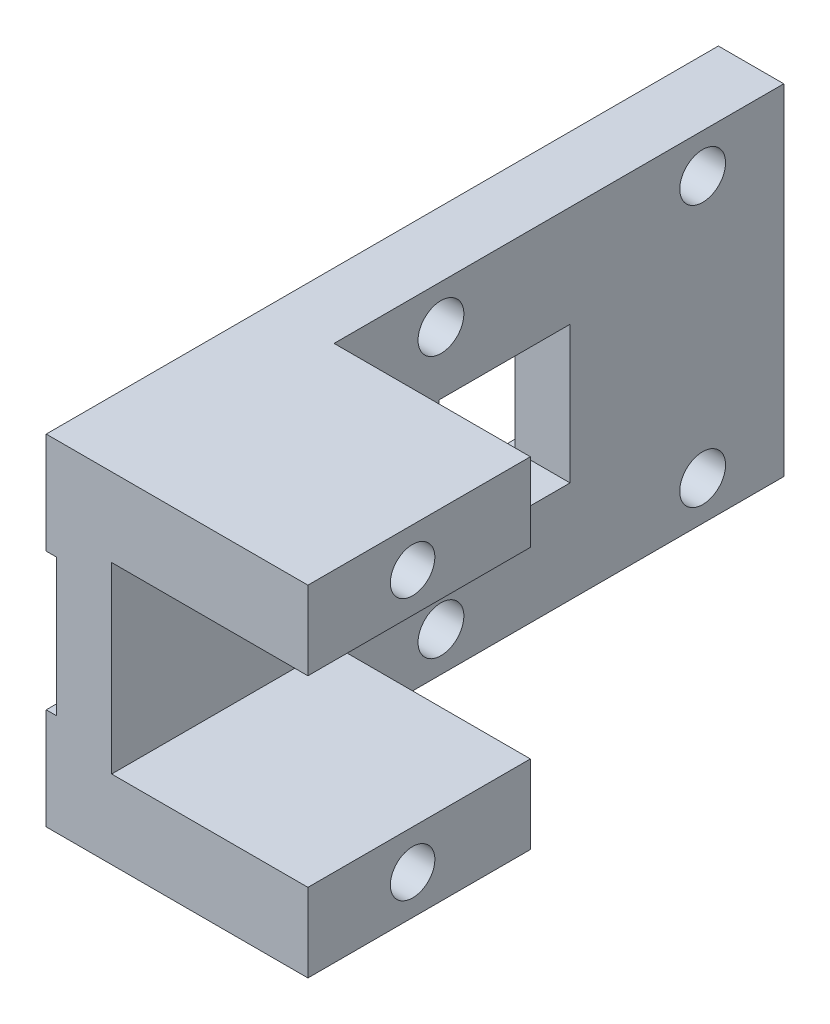
ISO-10303-21;
HEADER;
FILE_DESCRIPTION(('STEP AP214'),'2;1');
FILE_NAME('part.step','',(''),(''),'','','');
FILE_SCHEMA(('AUTOMOTIVE_DESIGN { 1 0 10303 214 1 1 1 1 }'));
ENDSEC;
DATA;
#1=APPLICATION_CONTEXT('core data for automotive mechanical design processes');
#2=APPLICATION_PROTOCOL_DEFINITION('international standard','automotive_design',2000,#1);
#3=PRODUCT_CONTEXT('',#1,'mechanical');
#4=PRODUCT('Part','Part','',(#3));
#5=PRODUCT_RELATED_PRODUCT_CATEGORY('part','',(#4));
#6=PRODUCT_DEFINITION_FORMATION('','',#4);
#7=PRODUCT_DEFINITION_CONTEXT('part definition',#1,'design');
#8=PRODUCT_DEFINITION('design','',#6,#7);
#9=PRODUCT_DEFINITION_SHAPE('','',#8);
#10=(LENGTH_UNIT() NAMED_UNIT(*) SI_UNIT(.MILLI.,.METRE.));
#11=(NAMED_UNIT(*) PLANE_ANGLE_UNIT() SI_UNIT($,.RADIAN.));
#12=(NAMED_UNIT(*) SI_UNIT($,.STERADIAN.) SOLID_ANGLE_UNIT());
#13=UNCERTAINTY_MEASURE_WITH_UNIT(LENGTH_MEASURE(1.E-05),#10,'distance_accuracy_value','');
#14=(GEOMETRIC_REPRESENTATION_CONTEXT(3) GLOBAL_UNCERTAINTY_ASSIGNED_CONTEXT((#13)) GLOBAL_UNIT_ASSIGNED_CONTEXT((#10,
#11,#12)) REPRESENTATION_CONTEXT('',''));
#15=CARTESIAN_POINT('',(0.,0.,0.));
#16=DIRECTION('',(0.,0.,1.));
#17=DIRECTION('',(1.,0.,0.));
#18=AXIS2_PLACEMENT_3D('',#15,#16,#17);
#19=CARTESIAN_POINT('',(-146.99996276809,-124.000037425625,-132.46692088768));
#20=DIRECTION('',(0.,1.,0.));
#21=DIRECTION('',(1.,0.,0.));
#22=AXIS2_PLACEMENT_3D('',#19,#20,#21);
#23=PLANE('',#22);
#24=DIRECTION('',(0.,0.,1.));
#25=VECTOR('',#24,1.);
#26=CARTESIAN_POINT('',(-146.99996276809,-124.000037425625,-132.46692088768));
#27=LINE('',#26,#25);
#28=CARTESIAN_POINT('',(-146.99996276809,-124.000037425625,-132.46692088768));
#29=VERTEX_POINT('',#28);
#30=CARTESIAN_POINT('',(-146.99996276809,-124.000037425625,-97.3000017784545));
#31=VERTEX_POINT('',#30);
#32=EDGE_CURVE('E436',#29,#31,#27,.T.);
#33=ORIENTED_EDGE('',*,*,#32,.F.);
#34=DIRECTION('',(0.,0.,1.));
#35=VECTOR('',#34,1.);
#36=CARTESIAN_POINT('',(-146.99996276809,-124.000037425625,-132.46692088768));
#37=LINE('',#36,#35);
#38=CARTESIAN_POINT('',(-146.99996276809,-124.000037425625,-148.66692088768));
#39=VERTEX_POINT('',#38);
#40=EDGE_CURVE('E362',#39,#29,#37,.T.);
#41=ORIENTED_EDGE('',*,*,#40,.F.);
#42=DIRECTION('',(-1.,0.,0.));
#43=VECTOR('',#42,1.);
#44=CARTESIAN_POINT('',(-146.99996276809,-124.000037425625,-148.66692088768));
#45=LINE('',#44,#43);
#46=CARTESIAN_POINT('',(-141.99996276809,-124.000037425625,-148.66692088768));
#47=VERTEX_POINT('',#46);
#48=EDGE_CURVE('E432',#47,#39,#45,.T.);
#49=ORIENTED_EDGE('',*,*,#48,.F.);
#50=DIRECTION('',(0.,0.,-1.));
#51=VECTOR('',#50,1.);
#52=CARTESIAN_POINT('',(-141.99996276809,-124.000037425625,-127.333461333067));
#53=LINE('',#52,#51);
#54=CARTESIAN_POINT('',(-141.99996276809,-124.000037425625,-132.46692088768));
#55=VERTEX_POINT('',#54);
#56=EDGE_CURVE('E435',#55,#47,#53,.T.);
#57=ORIENTED_EDGE('',*,*,#56,.F.);
#58=DIRECTION('',(0.,0.,1.));
#59=VECTOR('',#58,1.);
#60=CARTESIAN_POINT('',(-141.99996276809,-124.000037425625,-132.46692088768));
#61=LINE('',#60,#59);
#62=CARTESIAN_POINT('',(-141.99996276809,-124.000037425625,-114.300001778454));
#63=VERTEX_POINT('',#62);
#64=EDGE_CURVE('E401',#55,#63,#61,.T.);
#65=ORIENTED_EDGE('',*,*,#64,.T.);
#66=DIRECTION('',(1.,0.,0.));
#67=VECTOR('',#66,1.);
#68=CARTESIAN_POINT('',(-141.99996276809,-124.000037425625,-114.300001778454));
#69=LINE('',#68,#67);
#70=CARTESIAN_POINT('',(-126.99996276809,-124.000037425625,-114.300001778454));
#71=VERTEX_POINT('',#70);
#72=EDGE_CURVE('E374',#63,#71,#69,.T.);
#73=ORIENTED_EDGE('',*,*,#72,.T.);
#74=DIRECTION('',(0.,0.,1.));
#75=VECTOR('',#74,1.);
#76=CARTESIAN_POINT('',(-126.99996276809,-124.000037425625,-114.300001778454));
#77=LINE('',#76,#75);
#78=CARTESIAN_POINT('',(-126.99996276809,-124.000037425625,-97.3000017784545));
#79=VERTEX_POINT('',#78);
#80=EDGE_CURVE('E174',#71,#79,#77,.T.);
#81=ORIENTED_EDGE('',*,*,#80,.T.);
#82=DIRECTION('',(-1.,0.,0.));
#83=VECTOR('',#82,1.);
#84=CARTESIAN_POINT('',(-141.99996276809,-124.000037425625,-97.3000017784545));
#85=LINE('',#84,#83);
#86=EDGE_CURVE('E330',#79,#31,#85,.T.);
#87=ORIENTED_EDGE('',*,*,#86,.T.);
#88=EDGE_LOOP('',(#33,#41,#49,#57,#65,#73,#81,#87));
#89=FACE_BOUND('',#88,.T.);
#90=ADVANCED_FACE('F16',(#89),#23,.F.);
#91=CARTESIAN_POINT('',(-146.99996276809,-98.0000370381948,-106.000001778454));
#92=DIRECTION('',(0.,-1.,0.));
#93=DIRECTION('',(0.,0.,-1.));
#94=AXIS2_PLACEMENT_3D('',#91,#92,#93);
#95=PLANE('',#94);
#96=DIRECTION('',(0.,0.,1.));
#97=VECTOR('',#96,1.);
#98=CARTESIAN_POINT('',(-146.99996276809,-98.0000370381948,-106.000001778454));
#99=LINE('',#98,#97);
#100=CARTESIAN_POINT('',(-146.99996276809,-98.0000370381948,-132.46692088768));
#101=VERTEX_POINT('',#100);
#102=CARTESIAN_POINT('',(-146.99996276809,-98.0000370381948,-97.3000017784545));
#103=VERTEX_POINT('',#102);
#104=EDGE_CURVE('E446',#101,#103,#99,.T.);
#105=ORIENTED_EDGE('',*,*,#104,.T.);
#106=DIRECTION('',(1.,0.,0.));
#107=VECTOR('',#106,1.);
#108=CARTESIAN_POINT('',(-146.99996276809,-98.0000370381948,-97.3000017784545));
#109=LINE('',#108,#107);
#110=CARTESIAN_POINT('',(-126.99996276809,-98.0000370381948,-97.3000017784545));
#111=VERTEX_POINT('',#110);
#112=EDGE_CURVE('E326',#103,#111,#109,.T.);
#113=ORIENTED_EDGE('',*,*,#112,.T.);
#114=DIRECTION('',(0.,0.,1.));
#115=VECTOR('',#114,1.);
#116=CARTESIAN_POINT('',(-126.99996276809,-98.0000370381948,-102.300001778455));
#117=LINE('',#116,#115);
#118=CARTESIAN_POINT('',(-126.99996276809,-98.0000370381948,-114.300001778454));
#119=VERTEX_POINT('',#118);
#120=EDGE_CURVE('E398',#119,#111,#117,.T.);
#121=ORIENTED_EDGE('',*,*,#120,.F.);
#122=DIRECTION('',(1.,0.,0.));
#123=VECTOR('',#122,1.);
#124=CARTESIAN_POINT('',(-141.99996276809,-98.0000370381948,-114.300001778454));
#125=LINE('',#124,#123);
#126=CARTESIAN_POINT('',(-141.99996276809,-98.0000370381948,-114.300001778454));
#127=VERTEX_POINT('',#126);
#128=EDGE_CURVE('E307',#127,#119,#125,.T.);
#129=ORIENTED_EDGE('',*,*,#128,.F.);
#130=DIRECTION('',(0.,0.,1.));
#131=VECTOR('',#130,1.);
#132=CARTESIAN_POINT('',(-141.99996276809,-98.0000370381948,-106.000001778454));
#133=LINE('',#132,#131);
#134=CARTESIAN_POINT('',(-141.99996276809,-98.0000370381948,-132.46692088768));
#135=VERTEX_POINT('',#134);
#136=EDGE_CURVE('E423',#135,#127,#133,.T.);
#137=ORIENTED_EDGE('',*,*,#136,.F.);
#138=DIRECTION('',(0.,0.,1.));
#139=VECTOR('',#138,1.);
#140=CARTESIAN_POINT('',(-141.99996276809,-98.0000370381948,-127.333461333067));
#141=LINE('',#140,#139);
#142=CARTESIAN_POINT('',(-141.99996276809,-98.0000370381948,-148.66692088768));
#143=VERTEX_POINT('',#142);
#144=EDGE_CURVE('E427',#143,#135,#141,.T.);
#145=ORIENTED_EDGE('',*,*,#144,.F.);
#146=DIRECTION('',(1.,0.,0.));
#147=VECTOR('',#146,1.);
#148=CARTESIAN_POINT('',(-146.99996276809,-98.0000370381948,-148.66692088768));
#149=LINE('',#148,#147);
#150=CARTESIAN_POINT('',(-146.99996276809,-98.0000370381948,-148.66692088768));
#151=VERTEX_POINT('',#150);
#152=EDGE_CURVE('E102',#151,#143,#149,.T.);
#153=ORIENTED_EDGE('',*,*,#152,.F.);
#154=DIRECTION('',(0.,0.,-1.));
#155=VECTOR('',#154,1.);
#156=CARTESIAN_POINT('',(-146.99996276809,-98.0000370381948,-106.000001778454));
#157=LINE('',#156,#155);
#158=EDGE_CURVE('E20',#101,#151,#157,.T.);
#159=ORIENTED_EDGE('',*,*,#158,.F.);
#160=EDGE_LOOP('',(#105,#113,#121,#129,#137,#145,#153,#159));
#161=FACE_BOUND('',#160,.T.);
#162=ADVANCED_FACE('F563',(#161),#95,.F.);
#163=CARTESIAN_POINT('',(-146.99996276809,-101.00003723191,-122.46692088768));
#164=DIRECTION('',(-1.,0.,0.));
#165=DIRECTION('',(0.,-1.,0.));
#166=AXIS2_PLACEMENT_3D('',#163,#164,#165);
#167=CYLINDRICAL_SURFACE('',#166,1.75);
#168=CARTESIAN_POINT('',(-141.99996276809,-101.00003723191,-122.46692088768));
#169=DIRECTION('',(1.,0.,0.));
#170=DIRECTION('',(0.,-1.,0.));
#171=AXIS2_PLACEMENT_3D('',#168,#169,#170);
#172=CIRCLE('',#171,1.75);
#173=CARTESIAN_POINT('',(-141.99996276809,-99.25003723191,-122.46692088768));
#174=VERTEX_POINT('',#173);
#175=EDGE_CURVE('E321',#174,#174,#172,.T.);
#176=ORIENTED_EDGE('',*,*,#175,.T.);
#177=DIRECTION('',(-1.,0.,0.));
#178=VECTOR('',#177,1.);
#179=CARTESIAN_POINT('',(-146.99996276809,-99.25003723191,-122.46692088768));
#180=LINE('',#179,#178);
#181=CARTESIAN_POINT('',(-146.99996276809,-99.25003723191,-122.46692088768));
#182=VERTEX_POINT('',#181);
#183=EDGE_CURVE('E11',#174,#182,#180,.T.);
#184=ORIENTED_EDGE('',*,*,#183,.T.);
#185=CARTESIAN_POINT('',(-146.99996276809,-101.00003723191,-122.46692088768));
#186=DIRECTION('',(1.,0.,0.));
#187=DIRECTION('',(0.,-1.,0.));
#188=AXIS2_PLACEMENT_3D('',#185,#186,#187);
#189=CIRCLE('',#188,1.75);
#190=EDGE_CURVE('E367',#182,#182,#189,.T.);
#191=ORIENTED_EDGE('',*,*,#190,.F.);
#192=ORIENTED_EDGE('',*,*,#183,.F.);
#193=EDGE_LOOP('',(#176,#184,#191,#192));
#194=FACE_BOUND('',#193,.T.);
#195=ADVANCED_FACE('F607',(#194),#167,.F.);
#196=CARTESIAN_POINT('',(-146.99996276809,-121.00003723191,-142.46692088768));
#197=DIRECTION('',(-1.,0.,0.));
#198=DIRECTION('',(0.,-1.,0.));
#199=AXIS2_PLACEMENT_3D('',#196,#197,#198);
#200=CYLINDRICAL_SURFACE('',#199,1.75);
#201=CARTESIAN_POINT('',(-141.99996276809,-121.00003723191,-142.46692088768));
#202=DIRECTION('',(1.,0.,0.));
#203=DIRECTION('',(0.,-1.,0.));
#204=AXIS2_PLACEMENT_3D('',#201,#202,#203);
#205=CIRCLE('',#204,1.75);
#206=CARTESIAN_POINT('',(-141.99996276809,-119.25003723191,-142.46692088768));
#207=VERTEX_POINT('',#206);
#208=EDGE_CURVE('E316',#207,#207,#205,.T.);
#209=ORIENTED_EDGE('',*,*,#208,.T.);
#210=DIRECTION('',(-1.,0.,0.));
#211=VECTOR('',#210,1.);
#212=CARTESIAN_POINT('',(-146.99996276809,-119.25003723191,-142.46692088768));
#213=LINE('',#212,#211);
#214=CARTESIAN_POINT('',(-146.99996276809,-119.25003723191,-142.46692088768));
#215=VERTEX_POINT('',#214);
#216=EDGE_CURVE('E27',#207,#215,#213,.T.);
#217=ORIENTED_EDGE('',*,*,#216,.T.);
#218=CARTESIAN_POINT('',(-146.99996276809,-121.00003723191,-142.46692088768));
#219=DIRECTION('',(1.,0.,0.));
#220=DIRECTION('',(0.,-1.,0.));
#221=AXIS2_PLACEMENT_3D('',#218,#219,#220);
#222=CIRCLE('',#221,1.75);
#223=EDGE_CURVE('E386',#215,#215,#222,.T.);
#224=ORIENTED_EDGE('',*,*,#223,.F.);
#225=ORIENTED_EDGE('',*,*,#216,.F.);
#226=EDGE_LOOP('',(#209,#217,#224,#225));
#227=FACE_BOUND('',#226,.T.);
#228=ADVANCED_FACE('F615',(#227),#200,.F.);
#229=CARTESIAN_POINT('',(-146.99996276809,-121.00003723191,-122.46692088768));
#230=DIRECTION('',(-1.,0.,0.));
#231=DIRECTION('',(0.,-1.,0.));
#232=AXIS2_PLACEMENT_3D('',#229,#230,#231);
#233=CYLINDRICAL_SURFACE('',#232,1.75);
#234=CARTESIAN_POINT('',(-141.99996276809,-121.00003723191,-122.46692088768));
#235=DIRECTION('',(1.,0.,0.));
#236=DIRECTION('',(0.,-1.,0.));
#237=AXIS2_PLACEMENT_3D('',#234,#235,#236);
#238=CIRCLE('',#237,1.75);
#239=CARTESIAN_POINT('',(-141.99996276809,-119.25003723191,-122.46692088768));
#240=VERTEX_POINT('',#239);
#241=EDGE_CURVE('E320',#240,#240,#238,.T.);
#242=ORIENTED_EDGE('',*,*,#241,.T.);
#243=DIRECTION('',(-1.,0.,0.));
#244=VECTOR('',#243,1.);
#245=CARTESIAN_POINT('',(-146.99996276809,-119.25003723191,-122.46692088768));
#246=LINE('',#245,#244);
#247=CARTESIAN_POINT('',(-146.99996276809,-119.25003723191,-122.46692088768));
#248=VERTEX_POINT('',#247);
#249=EDGE_CURVE('E315',#240,#248,#246,.T.);
#250=ORIENTED_EDGE('',*,*,#249,.T.);
#251=CARTESIAN_POINT('',(-146.99996276809,-121.00003723191,-122.46692088768));
#252=DIRECTION('',(1.,0.,0.));
#253=DIRECTION('',(0.,-1.,0.));
#254=AXIS2_PLACEMENT_3D('',#251,#252,#253);
#255=CIRCLE('',#254,1.75);
#256=EDGE_CURVE('E391',#248,#248,#255,.T.);
#257=ORIENTED_EDGE('',*,*,#256,.F.);
#258=ORIENTED_EDGE('',*,*,#249,.F.);
#259=EDGE_LOOP('',(#242,#250,#257,#258));
#260=FACE_BOUND('',#259,.T.);
#261=ADVANCED_FACE('F640',(#260),#233,.F.);
#262=CARTESIAN_POINT('',(-146.99996276809,-101.00003723191,-142.46692088768));
#263=DIRECTION('',(-1.,0.,0.));
#264=DIRECTION('',(0.,-1.,0.));
#265=AXIS2_PLACEMENT_3D('',#262,#263,#264);
#266=CYLINDRICAL_SURFACE('',#265,1.75);
#267=CARTESIAN_POINT('',(-141.99996276809,-101.00003723191,-142.46692088768));
#268=DIRECTION('',(1.,0.,0.));
#269=DIRECTION('',(0.,-1.,0.));
#270=AXIS2_PLACEMENT_3D('',#267,#268,#269);
#271=CIRCLE('',#270,1.75);
#272=CARTESIAN_POINT('',(-141.99996276809,-99.25003723191,-142.46692088768));
#273=VERTEX_POINT('',#272);
#274=EDGE_CURVE('E378',#273,#273,#271,.T.);
#275=ORIENTED_EDGE('',*,*,#274,.T.);
#276=DIRECTION('',(-1.,0.,0.));
#277=VECTOR('',#276,1.);
#278=CARTESIAN_POINT('',(-146.99996276809,-99.25003723191,-142.46692088768));
#279=LINE('',#278,#277);
#280=CARTESIAN_POINT('',(-146.99996276809,-99.25003723191,-142.46692088768));
#281=VERTEX_POINT('',#280);
#282=EDGE_CURVE('E41',#273,#281,#279,.T.);
#283=ORIENTED_EDGE('',*,*,#282,.T.);
#284=CARTESIAN_POINT('',(-146.99996276809,-101.00003723191,-142.46692088768));
#285=DIRECTION('',(1.,0.,0.));
#286=DIRECTION('',(0.,-1.,0.));
#287=AXIS2_PLACEMENT_3D('',#284,#285,#286);
#288=CIRCLE('',#287,1.75);
#289=EDGE_CURVE('E370',#281,#281,#288,.T.);
#290=ORIENTED_EDGE('',*,*,#289,.F.);
#291=ORIENTED_EDGE('',*,*,#282,.F.);
#292=EDGE_LOOP('',(#275,#283,#290,#291));
#293=FACE_BOUND('',#292,.T.);
#294=ADVANCED_FACE('F656',(#293),#266,.F.);
#295=CARTESIAN_POINT('',(-146.19996276809,-111.00003723191,-127.333461333067));
#296=DIRECTION('',(-1.,0.,0.));
#297=DIRECTION('',(0.,1.,0.));
#298=AXIS2_PLACEMENT_3D('',#295,#296,#297);
#299=PLANE('',#298);
#300=DIRECTION('',(0.,-1.,0.));
#301=VECTOR('',#300,1.);
#302=CARTESIAN_POINT('',(-146.19996276809,-108.47503723191,-132.333461333067));
#303=LINE('',#302,#301);
#304=CARTESIAN_POINT('',(-146.19996276809,-105.75003723191,-132.333461333067));
#305=VERTEX_POINT('',#304);
#306=CARTESIAN_POINT('',(-146.19996276809,-116.25003723191,-132.333461333067));
#307=VERTEX_POINT('',#306);
#308=EDGE_CURVE('E381',#305,#307,#303,.T.);
#309=ORIENTED_EDGE('',*,*,#308,.F.);
#310=DIRECTION('',(0.,0.,1.));
#311=VECTOR('',#310,1.);
#312=CARTESIAN_POINT('',(-146.19996276809,-105.75003723191,-106.000001778454));
#313=LINE('',#312,#311);
#314=CARTESIAN_POINT('',(-146.19996276809,-105.75003723191,-148.66692088768));
#315=VERTEX_POINT('',#314);
#316=EDGE_CURVE('E298',#315,#305,#313,.T.);
#317=ORIENTED_EDGE('',*,*,#316,.F.);
#318=DIRECTION('',(0.,-1.,0.));
#319=VECTOR('',#318,1.);
#320=CARTESIAN_POINT('',(-146.19996276809,-108.525046394351,-148.66692088768));
#321=LINE('',#320,#319);
#322=CARTESIAN_POINT('',(-146.19996276809,-116.25003723191,-148.66692088768));
#323=VERTEX_POINT('',#322);
#324=EDGE_CURVE('E397',#315,#323,#321,.T.);
#325=ORIENTED_EDGE('',*,*,#324,.T.);
#326=DIRECTION('',(0.,0.,-1.));
#327=VECTOR('',#326,1.);
#328=CARTESIAN_POINT('',(-146.19996276809,-116.25003723191,-148.66692088768));
#329=LINE('',#328,#327);
#330=EDGE_CURVE('E358',#307,#323,#329,.T.);
#331=ORIENTED_EDGE('',*,*,#330,.F.);
#332=EDGE_LOOP('',(#309,#317,#325,#331));
#333=FACE_BOUND('',#332,.T.);
#334=ADVANCED_FACE('F659',(#333),#299,.T.);
#335=CARTESIAN_POINT('',(-146.19996276809,-111.00003723191,-127.333461333067));
#336=DIRECTION('',(-1.,0.,0.));
#337=DIRECTION('',(0.,1.,0.));
#338=AXIS2_PLACEMENT_3D('',#335,#336,#337);
#339=PLANE('',#338);
#340=DIRECTION('',(0.,1.,0.));
#341=VECTOR('',#340,1.);
#342=CARTESIAN_POINT('',(-146.19996276809,-113.52503723191,-122.333461333067));
#343=LINE('',#342,#341);
#344=CARTESIAN_POINT('',(-146.19996276809,-116.25003723191,-122.333461333067));
#345=VERTEX_POINT('',#344);
#346=CARTESIAN_POINT('',(-146.19996276809,-105.75003723191,-122.333461333067));
#347=VERTEX_POINT('',#346);
#348=EDGE_CURVE('E223',#345,#347,#343,.T.);
#349=ORIENTED_EDGE('',*,*,#348,.F.);
#350=DIRECTION('',(0.,0.,-1.));
#351=VECTOR('',#350,1.);
#352=CARTESIAN_POINT('',(-146.19996276809,-116.25003723191,-106.000001778454));
#353=LINE('',#352,#351);
#354=CARTESIAN_POINT('',(-146.19996276809,-116.25003723191,-97.3000017784545));
#355=VERTEX_POINT('',#354);
#356=EDGE_CURVE('E259',#355,#345,#353,.T.);
#357=ORIENTED_EDGE('',*,*,#356,.F.);
#358=DIRECTION('',(0.,1.,0.));
#359=VECTOR('',#358,1.);
#360=CARTESIAN_POINT('',(-146.19996276809,-120.025037328767,-97.3000017784545));
#361=LINE('',#360,#359);
#362=CARTESIAN_POINT('',(-146.19996276809,-105.75003723191,-97.3000017784545));
#363=VERTEX_POINT('',#362);
#364=EDGE_CURVE('E263',#355,#363,#361,.T.);
#365=ORIENTED_EDGE('',*,*,#364,.T.);
#366=DIRECTION('',(0.,0.,1.));
#367=VECTOR('',#366,1.);
#368=CARTESIAN_POINT('',(-146.19996276809,-105.75003723191,-106.000001778454));
#369=LINE('',#368,#367);
#370=EDGE_CURVE('E292',#347,#363,#369,.T.);
#371=ORIENTED_EDGE('',*,*,#370,.F.);
#372=EDGE_LOOP('',(#349,#357,#365,#371));
#373=FACE_BOUND('',#372,.T.);
#374=ADVANCED_FACE('F261',(#373),#339,.T.);
#375=CARTESIAN_POINT('',(-146.19996276809,-116.05003723191,-122.333461333067));
#376=DIRECTION('',(0.,0.,-1.));
#377=DIRECTION('',(0.,-1.,0.));
#378=AXIS2_PLACEMENT_3D('',#375,#376,#377);
#379=PLANE('',#378);
#380=DIRECTION('',(0.,-1.,0.));
#381=VECTOR('',#380,1.);
#382=CARTESIAN_POINT('',(-141.99996276809,-113.52503723191,-122.333461333067));
#383=LINE('',#382,#381);
#384=CARTESIAN_POINT('',(-141.99996276809,-105.75003723191,-122.333461333067));
#385=VERTEX_POINT('',#384);
#386=CARTESIAN_POINT('',(-141.99996276809,-116.25003723191,-122.333461333067));
#387=VERTEX_POINT('',#386);
#388=EDGE_CURVE('E234',#385,#387,#383,.T.);
#389=ORIENTED_EDGE('',*,*,#388,.T.);
#390=DIRECTION('',(1.,0.,0.));
#391=VECTOR('',#390,1.);
#392=CARTESIAN_POINT('',(-146.19996276809,-116.25003723191,-122.333461333067));
#393=LINE('',#392,#391);
#394=EDGE_CURVE('E268',#345,#387,#393,.T.);
#395=ORIENTED_EDGE('',*,*,#394,.F.);
#396=ORIENTED_EDGE('',*,*,#348,.T.);
#397=DIRECTION('',(-1.,0.,0.));
#398=VECTOR('',#397,1.);
#399=CARTESIAN_POINT('',(-146.19996276809,-105.75003723191,-122.333461333067));
#400=LINE('',#399,#398);
#401=EDGE_CURVE('E306',#385,#347,#400,.T.);
#402=ORIENTED_EDGE('',*,*,#401,.F.);
#403=EDGE_LOOP('',(#389,#395,#396,#402));
#404=FACE_BOUND('',#403,.T.);
#405=ADVANCED_FACE('F480',(#404),#379,.T.);
#406=CARTESIAN_POINT('',(-146.19996276809,-105.95003723191,-132.333461333067));
#407=DIRECTION('',(0.,0.,1.));
#408=DIRECTION('',(1.,0.,0.));
#409=AXIS2_PLACEMENT_3D('',#406,#407,#408);
#410=PLANE('',#409);
#411=DIRECTION('',(0.,1.,0.));
#412=VECTOR('',#411,1.);
#413=CARTESIAN_POINT('',(-141.99996276809,-113.52503723191,-132.333461333067));
#414=LINE('',#413,#412);
#415=CARTESIAN_POINT('',(-141.99996276809,-116.25003723191,-132.333461333067));
#416=VERTEX_POINT('',#415);
#417=CARTESIAN_POINT('',(-141.99996276809,-105.75003723191,-132.333461333067));
#418=VERTEX_POINT('',#417);
#419=EDGE_CURVE('E296',#416,#418,#414,.T.);
#420=ORIENTED_EDGE('',*,*,#419,.T.);
#421=DIRECTION('',(1.,0.,0.));
#422=VECTOR('',#421,1.);
#423=CARTESIAN_POINT('',(-146.19996276809,-105.75003723191,-132.333461333067));
#424=LINE('',#423,#422);
#425=EDGE_CURVE('E302',#305,#418,#424,.T.);
#426=ORIENTED_EDGE('',*,*,#425,.F.);
#427=ORIENTED_EDGE('',*,*,#308,.T.);
#428=DIRECTION('',(-1.,0.,0.));
#429=VECTOR('',#428,1.);
#430=CARTESIAN_POINT('',(-146.19996276809,-116.25003723191,-132.333461333067));
#431=LINE('',#430,#429);
#432=EDGE_CURVE('E345',#416,#307,#431,.T.);
#433=ORIENTED_EDGE('',*,*,#432,.F.);
#434=EDGE_LOOP('',(#420,#426,#427,#433));
#435=FACE_BOUND('',#434,.T.);
#436=ADVANCED_FACE('F633',(#435),#410,.T.);
#437=CARTESIAN_POINT('',(-141.99996276809,-111.00003723191,-127.333461333067));
#438=DIRECTION('',(-1.,0.,0.));
#439=DIRECTION('',(0.,0.,1.));
#440=AXIS2_PLACEMENT_3D('',#437,#438,#439);
#441=PLANE('',#440);
#442=ORIENTED_EDGE('',*,*,#274,.F.);
#443=EDGE_LOOP('',(#442));
#444=FACE_BOUND('',#443,.T.);
#445=ORIENTED_EDGE('',*,*,#241,.F.);
#446=EDGE_LOOP('',(#445));
#447=FACE_BOUND('',#446,.T.);
#448=ORIENTED_EDGE('',*,*,#208,.F.);
#449=EDGE_LOOP('',(#448));
#450=FACE_BOUND('',#449,.T.);
#451=ORIENTED_EDGE('',*,*,#175,.F.);
#452=EDGE_LOOP('',(#451));
#453=FACE_BOUND('',#452,.T.);
#454=ORIENTED_EDGE('',*,*,#388,.F.);
#455=DIRECTION('',(0.,0.,1.));
#456=VECTOR('',#455,1.);
#457=CARTESIAN_POINT('',(-141.99996276809,-105.75003723191,-116.666731555761));
#458=LINE('',#457,#456);
#459=EDGE_CURVE('E346',#418,#385,#458,.T.);
#460=ORIENTED_EDGE('',*,*,#459,.F.);
#461=ORIENTED_EDGE('',*,*,#419,.F.);
#462=DIRECTION('',(0.,0.,-1.));
#463=VECTOR('',#462,1.);
#464=CARTESIAN_POINT('',(-141.99996276809,-116.25003723191,-138.000191110373));
#465=LINE('',#464,#463);
#466=EDGE_CURVE('E341',#387,#416,#465,.T.);
#467=ORIENTED_EDGE('',*,*,#466,.F.);
#468=EDGE_LOOP('',(#454,#460,#461,#467));
#469=FACE_BOUND('',#468,.T.);
#470=DIRECTION('',(0.,0.,1.));
#471=VECTOR('',#470,1.);
#472=CARTESIAN_POINT('',(-141.99996276809,-118.000037425625,-114.816731555761));
#473=LINE('',#472,#471);
#474=CARTESIAN_POINT('',(-141.99996276809,-118.000037425625,-114.300001778454));
#475=VERTEX_POINT('',#474);
#476=CARTESIAN_POINT('',(-141.99996276809,-118.000037425625,-97.3000017784545));
#477=VERTEX_POINT('',#476);
#478=EDGE_CURVE('E377',#475,#477,#473,.T.);
#479=ORIENTED_EDGE('',*,*,#478,.F.);
#480=DIRECTION('',(0.,1.,0.));
#481=VECTOR('',#480,1.);
#482=CARTESIAN_POINT('',(-141.99996276809,-114.500037328767,-114.300001778454));
#483=LINE('',#482,#481);
#484=EDGE_CURVE('E340',#63,#475,#483,.T.);
#485=ORIENTED_EDGE('',*,*,#484,.F.);
#486=ORIENTED_EDGE('',*,*,#64,.F.);
#487=ORIENTED_EDGE('',*,*,#56,.T.);
#488=DIRECTION('',(0.,1.,0.));
#489=VECTOR('',#488,1.);
#490=CARTESIAN_POINT('',(-141.99996276809,-98.1000555567923,-148.66692088768));
#491=LINE('',#490,#489);
#492=EDGE_CURVE('E428',#47,#143,#491,.T.);
#493=ORIENTED_EDGE('',*,*,#492,.T.);
#494=ORIENTED_EDGE('',*,*,#144,.T.);
#495=ORIENTED_EDGE('',*,*,#136,.T.);
#496=DIRECTION('',(0.,1.,0.));
#497=VECTOR('',#496,1.);
#498=CARTESIAN_POINT('',(-141.99996276809,-104.500037135052,-114.300001778454));
#499=LINE('',#498,#497);
#500=CARTESIAN_POINT('',(-141.99996276809,-104.000037127602,-114.300001778454));
#501=VERTEX_POINT('',#500);
#502=EDGE_CURVE('E312',#501,#127,#499,.T.);
#503=ORIENTED_EDGE('',*,*,#502,.F.);
#504=DIRECTION('',(0.,0.,-1.));
#505=VECTOR('',#504,1.);
#506=CARTESIAN_POINT('',(-141.99996276809,-104.000037127602,-120.816731555761));
#507=LINE('',#506,#505);
#508=CARTESIAN_POINT('',(-141.99996276809,-104.000037127602,-97.3000017784545));
#509=VERTEX_POINT('',#508);
#510=EDGE_CURVE('E355',#509,#501,#507,.T.);
#511=ORIENTED_EDGE('',*,*,#510,.F.);
#512=DIRECTION('',(0.,-1.,0.));
#513=VECTOR('',#512,1.);
#514=CARTESIAN_POINT('',(-141.99996276809,-124.000037425625,-97.3000017784545));
#515=LINE('',#514,#513);
#516=EDGE_CURVE('E402',#509,#477,#515,.T.);
#517=ORIENTED_EDGE('',*,*,#516,.T.);
#518=EDGE_LOOP('',(#479,#485,#486,#487,#493,#494,#495,#503,#511,#517));
#519=FACE_BOUND('',#518,.T.);
#520=ADVANCED_FACE('F484',(#444,#447,#450,#453,#469,#519),#441,.F.);
#521=CARTESIAN_POINT('',(-126.99996276809,-101.000037082898,-108.300001778455));
#522=DIRECTION('',(-1.,0.,0.));
#523=DIRECTION('',(0.,1.,0.));
#524=AXIS2_PLACEMENT_3D('',#521,#522,#523);
#525=PLANE('',#524);
#526=CARTESIAN_POINT('',(-126.99996276809,-101.000037082898,-105.300001778455));
#527=DIRECTION('',(1.,0.,0.));
#528=DIRECTION('',(0.,-1.,0.));
#529=AXIS2_PLACEMENT_3D('',#526,#527,#528);
#530=CIRCLE('',#529,1.7);
#531=CARTESIAN_POINT('',(-126.99996276809,-99.3000370828983,-105.300001778455));
#532=VERTEX_POINT('',#531);
#533=EDGE_CURVE('E366',#532,#532,#530,.T.);
#534=ORIENTED_EDGE('',*,*,#533,.F.);
#535=EDGE_LOOP('',(#534));
#536=FACE_BOUND('',#535,.T.);
#537=DIRECTION('',(0.,-1.,0.));
#538=VECTOR('',#537,1.);
#539=CARTESIAN_POINT('',(-126.99996276809,-104.000037127602,-114.300001778454));
#540=LINE('',#539,#538);
#541=CARTESIAN_POINT('',(-126.99996276809,-104.000037127602,-114.300001778454));
#542=VERTEX_POINT('',#541);
#543=EDGE_CURVE('E311',#119,#542,#540,.T.);
#544=ORIENTED_EDGE('',*,*,#543,.F.);
#545=ORIENTED_EDGE('',*,*,#120,.T.);
#546=DIRECTION('',(0.,-1.,0.));
#547=VECTOR('',#546,1.);
#548=CARTESIAN_POINT('',(-126.99996276809,-98.0000370381948,-97.3000017784545));
#549=LINE('',#548,#547);
#550=CARTESIAN_POINT('',(-126.99996276809,-104.000037127602,-97.3000017784545));
#551=VERTEX_POINT('',#550);
#552=EDGE_CURVE('E322',#111,#551,#549,.T.);
#553=ORIENTED_EDGE('',*,*,#552,.T.);
#554=DIRECTION('',(0.,0.,1.));
#555=VECTOR('',#554,1.);
#556=CARTESIAN_POINT('',(-126.99996276809,-104.000037127602,-102.300001778455));
#557=LINE('',#556,#555);
#558=EDGE_CURVE('E354',#542,#551,#557,.T.);
#559=ORIENTED_EDGE('',*,*,#558,.F.);
#560=EDGE_LOOP('',(#544,#545,#553,#559));
#561=FACE_BOUND('',#560,.T.);
#562=ADVANCED_FACE('F570',(#536,#561),#525,.F.);
#563=CARTESIAN_POINT('',(-141.99996276809,-98.0000370381948,-114.300001778454));
#564=DIRECTION('',(0.,0.,1.));
#565=DIRECTION('',(1.,0.,0.));
#566=AXIS2_PLACEMENT_3D('',#563,#564,#565);
#567=PLANE('',#566);
#568=ORIENTED_EDGE('',*,*,#502,.T.);
#569=ORIENTED_EDGE('',*,*,#128,.T.);
#570=ORIENTED_EDGE('',*,*,#543,.T.);
#571=DIRECTION('',(1.,0.,0.));
#572=VECTOR('',#571,1.);
#573=CARTESIAN_POINT('',(-141.99996276809,-104.000037127602,-114.300001778454));
#574=LINE('',#573,#572);
#575=EDGE_CURVE('E350',#501,#542,#574,.T.);
#576=ORIENTED_EDGE('',*,*,#575,.F.);
#577=EDGE_LOOP('',(#568,#569,#570,#576));
#578=FACE_BOUND('',#577,.T.);
#579=ADVANCED_FACE('F567',(#578),#567,.F.);
#580=CARTESIAN_POINT('',(-141.99996276809,-104.000037127602,-114.300001778454));
#581=DIRECTION('',(0.,1.,0.));
#582=DIRECTION('',(1.,0.,0.));
#583=AXIS2_PLACEMENT_3D('',#580,#581,#582);
#584=PLANE('',#583);
#585=ORIENTED_EDGE('',*,*,#510,.T.);
#586=ORIENTED_EDGE('',*,*,#575,.T.);
#587=ORIENTED_EDGE('',*,*,#558,.T.);
#588=DIRECTION('',(-1.,0.,0.));
#589=VECTOR('',#588,1.);
#590=CARTESIAN_POINT('',(-141.99996276809,-104.000037127602,-97.3000017784545));
#591=LINE('',#590,#589);
#592=EDGE_CURVE('E327',#551,#509,#591,.T.);
#593=ORIENTED_EDGE('',*,*,#592,.T.);
#594=EDGE_LOOP('',(#585,#586,#587,#593));
#595=FACE_BOUND('',#594,.T.);
#596=ADVANCED_FACE('F546',(#595),#584,.F.);
#597=CARTESIAN_POINT('',(-126.99996276809,-121.000037425625,-108.300001778455));
#598=DIRECTION('',(-1.,0.,0.));
#599=DIRECTION('',(0.,1.,0.));
#600=AXIS2_PLACEMENT_3D('',#597,#598,#599);
#601=PLANE('',#600);
#602=CARTESIAN_POINT('',(-126.99996276809,-121.000037425625,-105.300001778455));
#603=DIRECTION('',(1.,0.,0.));
#604=DIRECTION('',(0.,-1.,0.));
#605=AXIS2_PLACEMENT_3D('',#602,#603,#604);
#606=CIRCLE('',#605,1.7);
#607=CARTESIAN_POINT('',(-126.99996276809,-119.300037425625,-105.300001778455));
#608=VERTEX_POINT('',#607);
#609=EDGE_CURVE('E493',#608,#608,#606,.T.);
#610=ORIENTED_EDGE('',*,*,#609,.F.);
#611=EDGE_LOOP('',(#610));
#612=FACE_BOUND('',#611,.T.);
#613=ORIENTED_EDGE('',*,*,#80,.F.);
#614=DIRECTION('',(0.,-1.,0.));
#615=VECTOR('',#614,1.);
#616=CARTESIAN_POINT('',(-126.99996276809,-118.000037425625,-114.300001778454));
#617=LINE('',#616,#615);
#618=CARTESIAN_POINT('',(-126.99996276809,-118.000037425625,-114.300001778454));
#619=VERTEX_POINT('',#618);
#620=EDGE_CURVE('E339',#619,#71,#617,.T.);
#621=ORIENTED_EDGE('',*,*,#620,.F.);
#622=DIRECTION('',(0.,0.,1.));
#623=VECTOR('',#622,1.);
#624=CARTESIAN_POINT('',(-126.99996276809,-118.000037425625,-102.300001778455));
#625=LINE('',#624,#623);
#626=CARTESIAN_POINT('',(-126.99996276809,-118.000037425625,-97.3000017784545));
#627=VERTEX_POINT('',#626);
#628=EDGE_CURVE('E190',#619,#627,#625,.T.);
#629=ORIENTED_EDGE('',*,*,#628,.T.);
#630=DIRECTION('',(0.,-1.,0.));
#631=VECTOR('',#630,1.);
#632=CARTESIAN_POINT('',(-126.99996276809,-124.000037425625,-97.3000017784545));
#633=LINE('',#632,#631);
#634=EDGE_CURVE('E420',#627,#79,#633,.T.);
#635=ORIENTED_EDGE('',*,*,#634,.T.);
#636=EDGE_LOOP('',(#613,#621,#629,#635));
#637=FACE_BOUND('',#636,.T.);
#638=ADVANCED_FACE('F577',(#612,#637),#601,.F.);
#639=CARTESIAN_POINT('',(-141.99996276809,-118.000037425625,-102.300001778455));
#640=DIRECTION('',(0.,-1.,0.));
#641=DIRECTION('',(0.,0.,-1.));
#642=AXIS2_PLACEMENT_3D('',#639,#640,#641);
#643=PLANE('',#642);
#644=ORIENTED_EDGE('',*,*,#478,.T.);
#645=DIRECTION('',(1.,0.,0.));
#646=VECTOR('',#645,1.);
#647=CARTESIAN_POINT('',(-141.99996276809,-118.000037425625,-97.3000017784545));
#648=LINE('',#647,#646);
#649=EDGE_CURVE('E406',#477,#627,#648,.T.);
#650=ORIENTED_EDGE('',*,*,#649,.T.);
#651=ORIENTED_EDGE('',*,*,#628,.F.);
#652=DIRECTION('',(1.,0.,0.));
#653=VECTOR('',#652,1.);
#654=CARTESIAN_POINT('',(-141.99996276809,-118.000037425625,-114.300001778454));
#655=LINE('',#654,#653);
#656=EDGE_CURVE('E335',#475,#619,#655,.T.);
#657=ORIENTED_EDGE('',*,*,#656,.F.);
#658=EDGE_LOOP('',(#644,#650,#651,#657));
#659=FACE_BOUND('',#658,.T.);
#660=ADVANCED_FACE('F575',(#659),#643,.F.);
#661=CARTESIAN_POINT('',(-141.99996276809,-118.000037425625,-114.300001778454));
#662=DIRECTION('',(0.,0.,1.));
#663=DIRECTION('',(1.,0.,0.));
#664=AXIS2_PLACEMENT_3D('',#661,#662,#663);
#665=PLANE('',#664);
#666=ORIENTED_EDGE('',*,*,#484,.T.);
#667=ORIENTED_EDGE('',*,*,#656,.T.);
#668=ORIENTED_EDGE('',*,*,#620,.T.);
#669=ORIENTED_EDGE('',*,*,#72,.F.);
#670=EDGE_LOOP('',(#666,#667,#668,#669));
#671=FACE_BOUND('',#670,.T.);
#672=ADVANCED_FACE('F580',(#671),#665,.F.);
#673=CARTESIAN_POINT('',(-126.99996276809,-101.000037082898,-105.300001778455));
#674=DIRECTION('',(1.,0.,0.));
#675=DIRECTION('',(0.,-1.,0.));
#676=AXIS2_PLACEMENT_3D('',#673,#674,#675);
#677=CYLINDRICAL_SURFACE('',#676,1.7);
#678=ORIENTED_EDGE('',*,*,#533,.T.);
#679=DIRECTION('',(-1.,0.,0.));
#680=VECTOR('',#679,1.);
#681=CARTESIAN_POINT('',(-126.99996276809,-99.3000370828983,-105.300001778455));
#682=LINE('',#681,#680);
#683=CARTESIAN_POINT('',(-146.99996276809,-99.3000370828983,-105.300001778455));
#684=VERTEX_POINT('',#683);
#685=EDGE_CURVE('E363',#532,#684,#682,.T.);
#686=ORIENTED_EDGE('',*,*,#685,.T.);
#687=CARTESIAN_POINT('',(-146.99996276809,-101.000037082898,-105.300001778455));
#688=DIRECTION('',(-1.,0.,0.));
#689=DIRECTION('',(0.,-1.,0.));
#690=AXIS2_PLACEMENT_3D('',#687,#688,#689);
#691=CIRCLE('',#690,1.7);
#692=EDGE_CURVE('E385',#684,#684,#691,.T.);
#693=ORIENTED_EDGE('',*,*,#692,.T.);
#694=ORIENTED_EDGE('',*,*,#685,.F.);
#695=EDGE_LOOP('',(#678,#686,#693,#694));
#696=FACE_BOUND('',#695,.T.);
#697=ADVANCED_FACE('F616',(#696),#677,.F.);
#698=CARTESIAN_POINT('',(-126.99996276809,-121.000037425625,-105.300001778455));
#699=DIRECTION('',(1.,0.,0.));
#700=DIRECTION('',(0.,-1.,0.));
#701=AXIS2_PLACEMENT_3D('',#698,#699,#700);
#702=CYLINDRICAL_SURFACE('',#701,1.7);
#703=ORIENTED_EDGE('',*,*,#609,.T.);
#704=DIRECTION('',(-1.,0.,0.));
#705=VECTOR('',#704,1.);
#706=CARTESIAN_POINT('',(-126.99996276809,-119.300037425625,-105.300001778455));
#707=LINE('',#706,#705);
#708=CARTESIAN_POINT('',(-146.99996276809,-119.300037425625,-105.300001778455));
#709=VERTEX_POINT('',#708);
#710=EDGE_CURVE('E497',#608,#709,#707,.T.);
#711=ORIENTED_EDGE('',*,*,#710,.T.);
#712=CARTESIAN_POINT('',(-146.99996276809,-121.000037425625,-105.300001778455));
#713=DIRECTION('',(-1.,0.,0.));
#714=DIRECTION('',(0.,-1.,0.));
#715=AXIS2_PLACEMENT_3D('',#712,#713,#714);
#716=CIRCLE('',#715,1.7);
#717=EDGE_CURVE('E390',#709,#709,#716,.T.);
#718=ORIENTED_EDGE('',*,*,#717,.T.);
#719=ORIENTED_EDGE('',*,*,#710,.F.);
#720=EDGE_LOOP('',(#703,#711,#718,#719));
#721=FACE_BOUND('',#720,.T.);
#722=ADVANCED_FACE('F618',(#721),#702,.F.);
#723=CARTESIAN_POINT('',(-146.99996276809,-111.00003723191,-127.333461333067));
#724=DIRECTION('',(-1.,0.,0.));
#725=DIRECTION('',(0.,0.,1.));
#726=AXIS2_PLACEMENT_3D('',#723,#724,#725);
#727=PLANE('',#726);
#728=ORIENTED_EDGE('',*,*,#717,.F.);
#729=EDGE_LOOP('',(#728));
#730=FACE_BOUND('',#729,.T.);
#731=ORIENTED_EDGE('',*,*,#223,.T.);
#732=EDGE_LOOP('',(#731));
#733=FACE_BOUND('',#732,.T.);
#734=ORIENTED_EDGE('',*,*,#256,.T.);
#735=EDGE_LOOP('',(#734));
#736=FACE_BOUND('',#735,.T.);
#737=DIRECTION('',(0.,0.,1.));
#738=VECTOR('',#737,1.);
#739=CARTESIAN_POINT('',(-146.99996276809,-116.25003723191,-138.000191110373));
#740=LINE('',#739,#738);
#741=CARTESIAN_POINT('',(-146.99996276809,-116.25003723191,-148.66692088768));
#742=VERTEX_POINT('',#741);
#743=CARTESIAN_POINT('',(-146.99996276809,-116.25003723191,-97.3000017784545));
#744=VERTEX_POINT('',#743);
#745=EDGE_CURVE('E269',#742,#744,#740,.T.);
#746=ORIENTED_EDGE('',*,*,#745,.F.);
#747=DIRECTION('',(0.,1.,0.));
#748=VECTOR('',#747,1.);
#749=CARTESIAN_POINT('',(-146.99996276809,-98.1000555567923,-148.66692088768));
#750=LINE('',#749,#748);
#751=EDGE_CURVE('E440',#39,#742,#750,.T.);
#752=ORIENTED_EDGE('',*,*,#751,.F.);
#753=ORIENTED_EDGE('',*,*,#40,.T.);
#754=ORIENTED_EDGE('',*,*,#32,.T.);
#755=DIRECTION('',(0.,1.,0.));
#756=VECTOR('',#755,1.);
#757=CARTESIAN_POINT('',(-146.99996276809,-124.000037425625,-97.3000017784545));
#758=LINE('',#757,#756);
#759=EDGE_CURVE('E280',#31,#744,#758,.T.);
#760=ORIENTED_EDGE('',*,*,#759,.T.);
#761=EDGE_LOOP('',(#746,#752,#753,#754,#760));
#762=FACE_BOUND('',#761,.T.);
#763=ADVANCED_FACE('F598',(#730,#733,#736,#762),#727,.T.);
#764=CARTESIAN_POINT('',(-146.99996276809,-116.25003723191,-148.66692088768));
#765=DIRECTION('',(0.,1.,0.));
#766=DIRECTION('',(1.,0.,0.));
#767=AXIS2_PLACEMENT_3D('',#764,#765,#766);
#768=PLANE('',#767);
#769=ORIENTED_EDGE('',*,*,#745,.T.);
#770=DIRECTION('',(1.,0.,0.));
#771=VECTOR('',#770,1.);
#772=CARTESIAN_POINT('',(-146.99996276809,-116.25003723191,-97.3000017784545));
#773=LINE('',#772,#771);
#774=EDGE_CURVE('E272',#744,#355,#773,.T.);
#775=ORIENTED_EDGE('',*,*,#774,.T.);
#776=ORIENTED_EDGE('',*,*,#356,.T.);
#777=ORIENTED_EDGE('',*,*,#394,.T.);
#778=ORIENTED_EDGE('',*,*,#466,.T.);
#779=ORIENTED_EDGE('',*,*,#432,.T.);
#780=ORIENTED_EDGE('',*,*,#330,.T.);
#781=DIRECTION('',(-1.,0.,0.));
#782=VECTOR('',#781,1.);
#783=CARTESIAN_POINT('',(-146.99996276809,-116.25003723191,-148.66692088768));
#784=LINE('',#783,#782);
#785=EDGE_CURVE('E410',#323,#742,#784,.T.);
#786=ORIENTED_EDGE('',*,*,#785,.T.);
#787=EDGE_LOOP('',(#769,#775,#776,#777,#778,#779,#780,#786));
#788=FACE_BOUND('',#787,.T.);
#789=ADVANCED_FACE('F273',(#788),#768,.T.);
#790=CARTESIAN_POINT('',(-146.99996276809,-111.100055556792,-148.66692088768));
#791=DIRECTION('',(0.,0.,1.));
#792=DIRECTION('',(0.,-1.,0.));
#793=AXIS2_PLACEMENT_3D('',#790,#791,#792);
#794=PLANE('',#793);
#795=DIRECTION('',(1.,0.,0.));
#796=VECTOR('',#795,1.);
#797=CARTESIAN_POINT('',(-146.99996276809,-105.75003723191,-148.66692088768));
#798=LINE('',#797,#796);
#799=CARTESIAN_POINT('',(-146.99996276809,-105.75003723191,-148.66692088768));
#800=VERTEX_POINT('',#799);
#801=EDGE_CURVE('E303',#800,#315,#798,.T.);
#802=ORIENTED_EDGE('',*,*,#801,.F.);
#803=DIRECTION('',(0.,1.,0.));
#804=VECTOR('',#803,1.);
#805=CARTESIAN_POINT('',(-146.99996276809,-98.1000555567923,-148.66692088768));
#806=LINE('',#805,#804);
#807=EDGE_CURVE('E371',#800,#151,#806,.T.);
#808=ORIENTED_EDGE('',*,*,#807,.T.);
#809=ORIENTED_EDGE('',*,*,#152,.T.);
#810=ORIENTED_EDGE('',*,*,#492,.F.);
#811=ORIENTED_EDGE('',*,*,#48,.T.);
#812=ORIENTED_EDGE('',*,*,#751,.T.);
#813=ORIENTED_EDGE('',*,*,#785,.F.);
#814=ORIENTED_EDGE('',*,*,#324,.F.);
#815=EDGE_LOOP('',(#802,#808,#809,#810,#811,#812,#813,#814));
#816=FACE_BOUND('',#815,.T.);
#817=ADVANCED_FACE('F587',(#816),#794,.F.);
#818=CARTESIAN_POINT('',(-146.99996276809,-111.00003723191,-127.333461333067));
#819=DIRECTION('',(-1.,0.,0.));
#820=DIRECTION('',(0.,0.,1.));
#821=AXIS2_PLACEMENT_3D('',#818,#819,#820);
#822=PLANE('',#821);
#823=ORIENTED_EDGE('',*,*,#692,.F.);
#824=EDGE_LOOP('',(#823));
#825=FACE_BOUND('',#824,.T.);
#826=ORIENTED_EDGE('',*,*,#289,.T.);
#827=EDGE_LOOP('',(#826));
#828=FACE_BOUND('',#827,.T.);
#829=ORIENTED_EDGE('',*,*,#190,.T.);
#830=EDGE_LOOP('',(#829));
#831=FACE_BOUND('',#830,.T.);
#832=DIRECTION('',(0.,0.,-1.));
#833=VECTOR('',#832,1.);
#834=CARTESIAN_POINT('',(-146.99996276809,-105.75003723191,-116.666731555761));
#835=LINE('',#834,#833);
#836=CARTESIAN_POINT('',(-146.99996276809,-105.75003723191,-97.3000017784545));
#837=VERTEX_POINT('',#836);
#838=EDGE_CURVE('E334',#837,#800,#835,.T.);
#839=ORIENTED_EDGE('',*,*,#838,.F.);
#840=DIRECTION('',(0.,1.,0.));
#841=VECTOR('',#840,1.);
#842=CARTESIAN_POINT('',(-146.99996276809,-124.000037425625,-97.3000017784545));
#843=LINE('',#842,#841);
#844=EDGE_CURVE('E449',#837,#103,#843,.T.);
#845=ORIENTED_EDGE('',*,*,#844,.T.);
#846=ORIENTED_EDGE('',*,*,#104,.F.);
#847=ORIENTED_EDGE('',*,*,#158,.T.);
#848=ORIENTED_EDGE('',*,*,#807,.F.);
#849=EDGE_LOOP('',(#839,#845,#846,#847,#848));
#850=FACE_BOUND('',#849,.T.);
#851=ADVANCED_FACE('F589',(#825,#828,#831,#850),#822,.T.);
#852=CARTESIAN_POINT('',(-146.99996276809,-124.000037425625,-97.3000017784545));
#853=DIRECTION('',(0.,0.,-1.));
#854=DIRECTION('',(0.,-1.,0.));
#855=AXIS2_PLACEMENT_3D('',#852,#853,#854);
#856=PLANE('',#855);
#857=ORIENTED_EDGE('',*,*,#364,.F.);
#858=ORIENTED_EDGE('',*,*,#774,.F.);
#859=ORIENTED_EDGE('',*,*,#759,.F.);
#860=ORIENTED_EDGE('',*,*,#86,.F.);
#861=ORIENTED_EDGE('',*,*,#634,.F.);
#862=ORIENTED_EDGE('',*,*,#649,.F.);
#863=ORIENTED_EDGE('',*,*,#516,.F.);
#864=ORIENTED_EDGE('',*,*,#592,.F.);
#865=ORIENTED_EDGE('',*,*,#552,.F.);
#866=ORIENTED_EDGE('',*,*,#112,.F.);
#867=ORIENTED_EDGE('',*,*,#844,.F.);
#868=DIRECTION('',(-1.,0.,0.));
#869=VECTOR('',#868,1.);
#870=CARTESIAN_POINT('',(-146.99996276809,-105.75003723191,-97.3000017784545));
#871=LINE('',#870,#869);
#872=EDGE_CURVE('E284',#363,#837,#871,.T.);
#873=ORIENTED_EDGE('',*,*,#872,.F.);
#874=EDGE_LOOP('',(#857,#858,#859,#860,#861,#862,#863,#864,#865,#866,#867,#873));
#875=FACE_BOUND('',#874,.T.);
#876=ADVANCED_FACE('F282',(#875),#856,.F.);
#877=CARTESIAN_POINT('',(-146.99996276809,-105.75003723191,-106.000001778454));
#878=DIRECTION('',(0.,-1.,0.));
#879=DIRECTION('',(0.,0.,-1.));
#880=AXIS2_PLACEMENT_3D('',#877,#878,#879);
#881=PLANE('',#880);
#882=ORIENTED_EDGE('',*,*,#838,.T.);
#883=ORIENTED_EDGE('',*,*,#801,.T.);
#884=ORIENTED_EDGE('',*,*,#316,.T.);
#885=ORIENTED_EDGE('',*,*,#425,.T.);
#886=ORIENTED_EDGE('',*,*,#459,.T.);
#887=ORIENTED_EDGE('',*,*,#401,.T.);
#888=ORIENTED_EDGE('',*,*,#370,.T.);
#889=ORIENTED_EDGE('',*,*,#872,.T.);
#890=EDGE_LOOP('',(#882,#883,#884,#885,#886,#887,#888,#889));
#891=FACE_BOUND('',#890,.T.);
#892=ADVANCED_FACE('F18',(#891),#881,.T.);
#893=CLOSED_SHELL('',(#90,#162,#195,#228,#261,#294,#334,#374,#405,#436,#520,#562,#579,#596,#638,
#660,#672,#697,#722,#763,#789,#817,#851,#876,#892));
#894=MANIFOLD_SOLID_BREP('B1',#893);
#895=ADVANCED_BREP_SHAPE_REPRESENTATION('',(#18,#894),#14);
#896=SHAPE_DEFINITION_REPRESENTATION(#9,#895);
ENDSEC;
END-ISO-10303-21;
